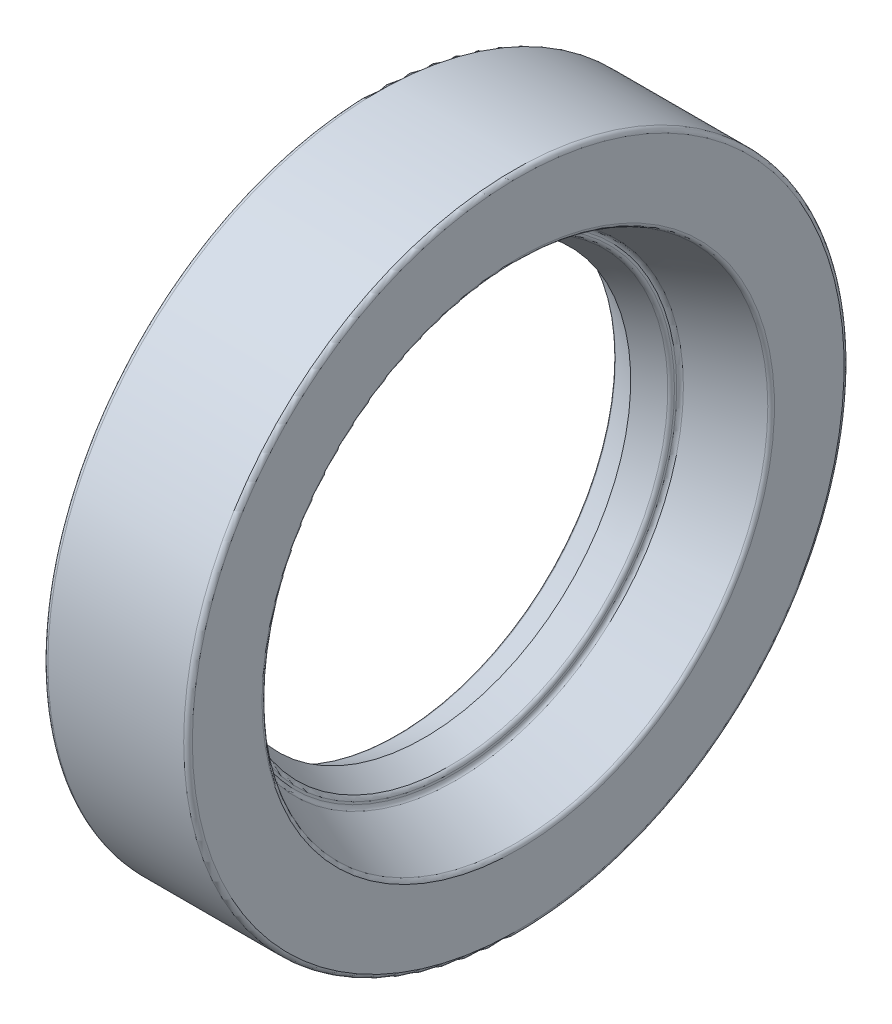
ISO-10303-21;
HEADER;
FILE_DESCRIPTION(('STEP AP214'),'2;1');
FILE_NAME('part.step','',(''),(''),'','','');
FILE_SCHEMA(('AUTOMOTIVE_DESIGN { 1 0 10303 214 1 1 1 1 }'));
ENDSEC;
DATA;
#1=APPLICATION_CONTEXT('core data for automotive mechanical design processes');
#2=APPLICATION_PROTOCOL_DEFINITION('international standard','automotive_design',2000,#1);
#3=PRODUCT_CONTEXT('',#1,'mechanical');
#4=PRODUCT('Part','Part','',(#3));
#5=PRODUCT_RELATED_PRODUCT_CATEGORY('part','',(#4));
#6=PRODUCT_DEFINITION_FORMATION('','',#4);
#7=PRODUCT_DEFINITION_CONTEXT('part definition',#1,'design');
#8=PRODUCT_DEFINITION('design','',#6,#7);
#9=PRODUCT_DEFINITION_SHAPE('','',#8);
#10=(LENGTH_UNIT() NAMED_UNIT(*) SI_UNIT(.MILLI.,.METRE.));
#11=(NAMED_UNIT(*) PLANE_ANGLE_UNIT() SI_UNIT($,.RADIAN.));
#12=(NAMED_UNIT(*) SI_UNIT($,.STERADIAN.) SOLID_ANGLE_UNIT());
#13=UNCERTAINTY_MEASURE_WITH_UNIT(LENGTH_MEASURE(1.E-05),#10,'distance_accuracy_value','');
#14=(GEOMETRIC_REPRESENTATION_CONTEXT(3) GLOBAL_UNCERTAINTY_ASSIGNED_CONTEXT((#13)) GLOBAL_UNIT_ASSIGNED_CONTEXT((#10,
#11,#12)) REPRESENTATION_CONTEXT('',''));
#15=CARTESIAN_POINT('',(0.,0.,0.));
#16=DIRECTION('',(0.,0.,1.));
#17=DIRECTION('',(1.,0.,0.));
#18=AXIS2_PLACEMENT_3D('',#15,#16,#17);
#19=CARTESIAN_POINT('',(0.,0.,0.));
#20=DIRECTION('',(-1.,0.,0.));
#21=DIRECTION('',(0.,0.,1.));
#22=AXIS2_PLACEMENT_3D('',#19,#20,#21);
#23=TOROIDAL_SURFACE('',#22,11.75,0.105);
#24=CARTESIAN_POINT('',(0.,0.,11.855));
#25=VERTEX_POINT('',#24);
#26=VERTEX_LOOP('',#25);
#27=FACE_BOUND('',#26,.T.);
#28=ADVANCED_FACE('F36',(#27),#23,.T.);
#29=CLOSED_SHELL('',(#28));
#30=MANIFOLD_SOLID_BREP('B2',#29);
#31=CARTESIAN_POINT('',(0.,0.,0.));
#32=DIRECTION('',(-1.,0.,0.));
#33=DIRECTION('',(0.,0.,1.));
#34=AXIS2_PLACEMENT_3D('',#31,#32,#33);
#35=TOROIDAL_SURFACE('',#34,11.75,0.525000000000003);
#36=CARTESIAN_POINT('',(0.,0.,12.275));
#37=VERTEX_POINT('',#36);
#38=VERTEX_LOOP('',#37);
#39=FACE_BOUND('',#38,.T.);
#40=ADVANCED_FACE('F57',(#39),#35,.T.);
#41=CLOSED_SHELL('',(#40));
#42=CARTESIAN_POINT('',(0.,0.,0.));
#43=DIRECTION('',(-1.,0.,0.));
#44=DIRECTION('',(0.,0.,1.));
#45=AXIS2_PLACEMENT_3D('',#42,#43,#44);
#46=TOROIDAL_SURFACE('',#45,11.75,0.425516390000003);
#47=CARTESIAN_POINT('',(0.,0.,12.17551639));
#48=VERTEX_POINT('',#47);
#49=VERTEX_LOOP('',#48);
#50=FACE_BOUND('',#49,.T.);
#51=ADVANCED_FACE('F70',(#50),#46,.F.);
#52=CLOSED_SHELL('',(#51));
#53=ORIENTED_CLOSED_SHELL('',*,#52,.T.);
#54=BREP_WITH_VOIDS('B6',#41,(#53));
#55=CARTESIAN_POINT('',(-2.45,15.16,0.));
#56=DIRECTION('',(1.,0.,0.));
#57=DIRECTION('',(0.,0.,-1.));
#58=AXIS2_PLACEMENT_3D('',#55,#56,#57);
#59=PLANE('',#58);
#60=CARTESIAN_POINT('',(-2.45,0.,0.));
#61=DIRECTION('',(1.,0.,0.));
#62=DIRECTION('',(0.,0.,-1.));
#63=AXIS2_PLACEMENT_3D('',#60,#61,#62);
#64=CIRCLE('',#63,15.3627946427095);
#65=CARTESIAN_POINT('',(-2.45,0.,-15.3627946427095));
#66=VERTEX_POINT('',#65);
#67=EDGE_CURVE('E100',#66,#66,#64,.T.);
#68=ORIENTED_EDGE('',*,*,#67,.T.);
#69=EDGE_LOOP('',(#68));
#70=FACE_BOUND('',#69,.T.);
#71=CARTESIAN_POINT('',(-2.45,0.,0.));
#72=DIRECTION('',(1.,0.,0.));
#73=DIRECTION('',(0.,0.,-1.));
#74=AXIS2_PLACEMENT_3D('',#71,#72,#73);
#75=CIRCLE('',#74,15.79);
#76=CARTESIAN_POINT('',(-2.45,0.,-15.79));
#77=VERTEX_POINT('',#76);
#78=EDGE_CURVE('E103',#77,#77,#75,.F.);
#79=ORIENTED_EDGE('',*,*,#78,.T.);
#80=EDGE_LOOP('',(#79));
#81=FACE_BOUND('',#80,.T.);
#82=ADVANCED_FACE('F81',(#70,#81),#59,.F.);
#83=CARTESIAN_POINT('',(-2.45,0.,0.));
#84=DIRECTION('',(-1.,0.,0.));
#85=DIRECTION('',(0.,0.,1.));
#86=AXIS2_PLACEMENT_3D('',#83,#84,#85);
#87=CONICAL_SURFACE('',#86,15.16,0.0349065850398794);
#88=CARTESIAN_POINT('',(3.29732889430752,0.,0.));
#89=DIRECTION('',(-1.,0.,0.));
#90=DIRECTION('',(0.,0.,1.));
#91=AXIS2_PLACEMENT_3D('',#88,#89,#90);
#92=CIRCLE('',#91,14.9592988524887);
#93=CARTESIAN_POINT('',(3.29732889430752,0.,14.9592988524887));
#94=VERTEX_POINT('',#93);
#95=EDGE_CURVE('E106',#94,#94,#92,.F.);
#96=ORIENTED_EDGE('',*,*,#95,.T.);
#97=EDGE_LOOP('',(#96));
#98=FACE_BOUND('',#97,.T.);
#99=CARTESIAN_POINT('',(-2.24732889430751,0.,0.));
#100=DIRECTION('',(1.,0.,0.));
#101=DIRECTION('',(0.,0.,-1.));
#102=AXIS2_PLACEMENT_3D('',#99,#100,#101);
#103=CIRCLE('',#102,15.1529225690355);
#104=CARTESIAN_POINT('',(-2.24732889430751,0.,-15.1529225690355));
#105=VERTEX_POINT('',#104);
#106=EDGE_CURVE('E109',#105,#105,#103,.F.);
#107=ORIENTED_EDGE('',*,*,#106,.T.);
#108=EDGE_LOOP('',(#107));
#109=FACE_BOUND('',#108,.T.);
#110=ADVANCED_FACE('F182',(#98,#109),#87,.F.);
#111=CARTESIAN_POINT('',(3.5,12.3856014284556,0.));
#112=DIRECTION('',(1.,0.,0.));
#113=DIRECTION('',(0.,0.,-1.));
#114=AXIS2_PLACEMENT_3D('',#111,#112,#113);
#115=PLANE('',#114);
#116=CARTESIAN_POINT('',(3.5,0.,0.));
#117=DIRECTION('',(1.,0.,0.));
#118=DIRECTION('',(0.,0.,-1.));
#119=AXIS2_PLACEMENT_3D('',#116,#117,#118);
#120=CIRCLE('',#119,12.5259189424187);
#121=CARTESIAN_POINT('',(3.5,0.,-12.5259189424187));
#122=VERTEX_POINT('',#121);
#123=EDGE_CURVE('E112',#122,#122,#120,.T.);
#124=ORIENTED_EDGE('',*,*,#123,.T.);
#125=EDGE_LOOP('',(#124));
#126=FACE_BOUND('',#125,.T.);
#127=CARTESIAN_POINT('',(3.5,0.,0.));
#128=DIRECTION('',(1.,0.,0.));
#129=DIRECTION('',(0.,0.,-1.));
#130=AXIS2_PLACEMENT_3D('',#127,#128,#129);
#131=CIRCLE('',#130,14.7494267788147);
#132=CARTESIAN_POINT('',(3.5,0.,-14.7494267788147));
#133=VERTEX_POINT('',#132);
#134=EDGE_CURVE('E115',#133,#133,#131,.F.);
#135=ORIENTED_EDGE('',*,*,#134,.T.);
#136=EDGE_LOOP('',(#135));
#137=FACE_BOUND('',#136,.T.);
#138=ADVANCED_FACE('F187',(#126,#137),#115,.F.);
#139=CARTESIAN_POINT('',(3.5,0.,0.));
#140=DIRECTION('',(1.,0.,0.));
#141=DIRECTION('',(0.,0.,-1.));
#142=AXIS2_PLACEMENT_3D('',#139,#140,#141);
#143=CONICAL_SURFACE('',#142,12.3856014284556,0.392699081698726);
#144=CARTESIAN_POINT('',(2.00411433480569,0.,0.));
#145=DIRECTION('',(1.,0.,0.));
#146=DIRECTION('',(0.,0.,-1.));
#147=AXIS2_PLACEMENT_3D('',#144,#145,#146);
#148=CIRCLE('',#147,11.7659852981726);
#149=CARTESIAN_POINT('',(2.00411433480569,0.,-11.7659852981726));
#150=VERTEX_POINT('',#149);
#151=EDGE_CURVE('E118',#150,#150,#148,.T.);
#152=ORIENTED_EDGE('',*,*,#151,.T.);
#153=EDGE_LOOP('',(#152));
#154=FACE_BOUND('',#153,.T.);
#155=CARTESIAN_POINT('',(3.37036352079667,0.,0.));
#156=DIRECTION('',(1.,0.,0.));
#157=DIRECTION('',(0.,0.,-1.));
#158=AXIS2_PLACEMENT_3D('',#155,#156,#157);
#159=CIRCLE('',#158,12.3319042405913);
#160=CARTESIAN_POINT('',(3.37036352079667,0.,-12.3319042405913));
#161=VERTEX_POINT('',#160);
#162=EDGE_CURVE('E121',#161,#161,#159,.F.);
#163=ORIENTED_EDGE('',*,*,#162,.T.);
#164=EDGE_LOOP('',(#163));
#165=FACE_BOUND('',#164,.T.);
#166=ADVANCED_FACE('F393',(#154,#165),#143,.T.);
#167=CARTESIAN_POINT('',(0.,0.,0.));
#168=DIRECTION('',(-1.,0.,0.));
#169=DIRECTION('',(0.,0.,1.));
#170=AXIS2_PLACEMENT_3D('',#167,#168,#169);
#171=CYLINDRICAL_SURFACE('',#170,11.75);
#172=CARTESIAN_POINT('',(1.92375081400902,0.,0.));
#173=DIRECTION('',(-1.,0.,0.));
#174=DIRECTION('',(0.,0.,1.));
#175=AXIS2_PLACEMENT_3D('',#172,#173,#174);
#176=CIRCLE('',#175,11.75);
#177=CARTESIAN_POINT('',(1.92375081400902,0.,11.75));
#178=VERTEX_POINT('',#177);
#179=EDGE_CURVE('E124',#178,#178,#176,.T.);
#180=ORIENTED_EDGE('',*,*,#179,.T.);
#181=EDGE_LOOP('',(#180));
#182=FACE_BOUND('',#181,.T.);
#183=CARTESIAN_POINT('',(0.525000000000003,0.,0.));
#184=DIRECTION('',(-1.,0.,0.));
#185=DIRECTION('',(0.,0.,1.));
#186=AXIS2_PLACEMENT_3D('',#183,#184,#185);
#187=CIRCLE('',#186,11.75);
#188=CARTESIAN_POINT('',(0.525000000000003,0.,11.75));
#189=VERTEX_POINT('',#188);
#190=EDGE_CURVE('E154',#189,#189,#187,.T.);
#191=ORIENTED_EDGE('',*,*,#190,.F.);
#192=EDGE_LOOP('',(#191));
#193=FACE_BOUND('',#192,.T.);
#194=ADVANCED_FACE('F385',(#182,#193),#171,.T.);
#195=CARTESIAN_POINT('',(0.,0.,0.));
#196=DIRECTION('',(-1.,0.,0.));
#197=DIRECTION('',(0.,0.,1.));
#198=AXIS2_PLACEMENT_3D('',#195,#196,#197);
#199=TOROIDAL_SURFACE('',#198,11.75,0.525000000000003);
#200=CARTESIAN_POINT('',(-0.525,0.,0.));
#201=DIRECTION('',(-1.,0.,0.));
#202=DIRECTION('',(0.,0.,1.));
#203=AXIS2_PLACEMENT_3D('',#200,#201,#202);
#204=CIRCLE('',#203,11.75);
#205=CARTESIAN_POINT('',(-0.525,0.,11.75));
#206=VERTEX_POINT('',#205);
#207=EDGE_CURVE('E157',#206,#206,#204,.T.);
#208=ORIENTED_EDGE('',*,*,#207,.F.);
#209=EDGE_LOOP('',(#208));
#210=FACE_BOUND('',#209,.T.);
#211=ORIENTED_EDGE('',*,*,#190,.T.);
#212=EDGE_LOOP('',(#211));
#213=FACE_BOUND('',#212,.T.);
#214=ADVANCED_FACE('F375',(#210,#213),#199,.F.);
#215=CARTESIAN_POINT('',(0.,0.,0.));
#216=DIRECTION('',(-1.,0.,0.));
#217=DIRECTION('',(0.,0.,1.));
#218=AXIS2_PLACEMENT_3D('',#215,#216,#217);
#219=CYLINDRICAL_SURFACE('',#218,11.75);
#220=CARTESIAN_POINT('',(-1.19,0.,0.));
#221=DIRECTION('',(1.,0.,0.));
#222=DIRECTION('',(0.,0.,-1.));
#223=AXIS2_PLACEMENT_3D('',#220,#221,#222);
#224=CIRCLE('',#223,11.75);
#225=CARTESIAN_POINT('',(-1.19,0.,-11.75));
#226=VERTEX_POINT('',#225);
#227=EDGE_CURVE('E127',#226,#226,#224,.T.);
#228=ORIENTED_EDGE('',*,*,#227,.T.);
#229=EDGE_LOOP('',(#228));
#230=FACE_BOUND('',#229,.T.);
#231=ORIENTED_EDGE('',*,*,#207,.T.);
#232=EDGE_LOOP('',(#231));
#233=FACE_BOUND('',#232,.T.);
#234=ADVANCED_FACE('F178',(#230,#233),#219,.T.);
#235=CARTESIAN_POINT('',(-1.4,10.5798989873223,0.));
#236=DIRECTION('',(1.,0.,0.));
#237=DIRECTION('',(0.,0.,-1.));
#238=AXIS2_PLACEMENT_3D('',#235,#236,#237);
#239=PLANE('',#238);
#240=CARTESIAN_POINT('',(-1.4,0.,0.));
#241=DIRECTION('',(1.,0.,0.));
#242=DIRECTION('',(0.,0.,-1.));
#243=AXIS2_PLACEMENT_3D('',#240,#241,#242);
#244=CIRCLE('',#243,10.7202165012854);
#245=CARTESIAN_POINT('',(-1.4,0.,-10.7202165012854));
#246=VERTEX_POINT('',#245);
#247=EDGE_CURVE('E130',#246,#246,#244,.T.);
#248=ORIENTED_EDGE('',*,*,#247,.T.);
#249=EDGE_LOOP('',(#248));
#250=FACE_BOUND('',#249,.T.);
#251=CARTESIAN_POINT('',(-1.4,0.,0.));
#252=DIRECTION('',(1.,0.,0.));
#253=DIRECTION('',(0.,0.,-1.));
#254=AXIS2_PLACEMENT_3D('',#251,#252,#253);
#255=CIRCLE('',#254,11.54);
#256=CARTESIAN_POINT('',(-1.4,0.,-11.54));
#257=VERTEX_POINT('',#256);
#258=EDGE_CURVE('E133',#257,#257,#255,.F.);
#259=ORIENTED_EDGE('',*,*,#258,.T.);
#260=EDGE_LOOP('',(#259));
#261=FACE_BOUND('',#260,.T.);
#262=ADVANCED_FACE('F168',(#250,#261),#239,.F.);
#263=CARTESIAN_POINT('',(-1.4,0.,0.));
#264=DIRECTION('',(-1.,0.,0.));
#265=DIRECTION('',(0.,0.,1.));
#266=AXIS2_PLACEMENT_3D('',#263,#264,#265);
#267=CONICAL_SURFACE('',#266,10.5798989873223,0.392699081698726);
#268=CARTESIAN_POINT('',(-1.27036352079667,0.,0.));
#269=DIRECTION('',(1.,0.,0.));
#270=DIRECTION('',(0.,0.,-1.));
#271=AXIS2_PLACEMENT_3D('',#268,#269,#270);
#272=CIRCLE('',#271,10.526201799458);
#273=CARTESIAN_POINT('',(-1.27036352079667,0.,-10.526201799458));
#274=VERTEX_POINT('',#273);
#275=EDGE_CURVE('E136',#274,#274,#272,.F.);
#276=ORIENTED_EDGE('',*,*,#275,.T.);
#277=EDGE_LOOP('',(#276));
#278=FACE_BOUND('',#277,.T.);
#279=CARTESIAN_POINT('',(0.,0.,0.));
#280=DIRECTION('',(-1.,0.,0.));
#281=DIRECTION('',(0.,0.,1.));
#282=AXIS2_PLACEMENT_3D('',#279,#280,#281);
#283=CIRCLE('',#282,10.);
#284=CARTESIAN_POINT('',(0.,0.,10.));
#285=VERTEX_POINT('',#284);
#286=EDGE_CURVE('E160',#285,#285,#283,.T.);
#287=ORIENTED_EDGE('',*,*,#286,.F.);
#288=EDGE_LOOP('',(#287));
#289=FACE_BOUND('',#288,.T.);
#290=ADVANCED_FACE('F166',(#278,#289),#267,.F.);
#291=CARTESIAN_POINT('',(0.,0.,0.));
#292=DIRECTION('',(1.,0.,0.));
#293=DIRECTION('',(0.,0.,-1.));
#294=AXIS2_PLACEMENT_3D('',#291,#292,#293);
#295=CONICAL_SURFACE('',#294,10.,0.392699081698726);
#296=CARTESIAN_POINT('',(1.27036352079667,0.,0.));
#297=DIRECTION('',(-1.,0.,0.));
#298=DIRECTION('',(0.,0.,1.));
#299=AXIS2_PLACEMENT_3D('',#296,#297,#298);
#300=CIRCLE('',#299,10.526201799458);
#301=CARTESIAN_POINT('',(1.27036352079667,0.,10.526201799458));
#302=VERTEX_POINT('',#301);
#303=EDGE_CURVE('E139',#302,#302,#300,.F.);
#304=ORIENTED_EDGE('',*,*,#303,.T.);
#305=EDGE_LOOP('',(#304));
#306=FACE_BOUND('',#305,.T.);
#307=ORIENTED_EDGE('',*,*,#286,.T.);
#308=EDGE_LOOP('',(#307));
#309=FACE_BOUND('',#308,.T.);
#310=ADVANCED_FACE('F164',(#306,#309),#295,.F.);
#311=CARTESIAN_POINT('',(1.4,10.9702272785248,0.));
#312=DIRECTION('',(-1.,0.,0.));
#313=DIRECTION('',(0.,0.,1.));
#314=AXIS2_PLACEMENT_3D('',#311,#312,#313);
#315=PLANE('',#314);
#316=CARTESIAN_POINT('',(1.4,0.,0.));
#317=DIRECTION('',(-1.,0.,0.));
#318=DIRECTION('',(0.,0.,1.));
#319=AXIS2_PLACEMENT_3D('',#316,#317,#318);
#320=CIRCLE('',#319,10.8299097645617);
#321=CARTESIAN_POINT('',(1.4,0.,10.8299097645617));
#322=VERTEX_POINT('',#321);
#323=EDGE_CURVE('E142',#322,#322,#320,.F.);
#324=ORIENTED_EDGE('',*,*,#323,.T.);
#325=EDGE_LOOP('',(#324));
#326=FACE_BOUND('',#325,.T.);
#327=CARTESIAN_POINT('',(1.4,0.,0.));
#328=DIRECTION('',(-1.,0.,0.));
#329=DIRECTION('',(0.,0.,1.));
#330=AXIS2_PLACEMENT_3D('',#327,#328,#329);
#331=CIRCLE('',#330,10.7202165012854);
#332=CARTESIAN_POINT('',(1.4,0.,10.7202165012854));
#333=VERTEX_POINT('',#332);
#334=EDGE_CURVE('E145',#333,#333,#331,.T.);
#335=ORIENTED_EDGE('',*,*,#334,.T.);
#336=EDGE_LOOP('',(#335));
#337=FACE_BOUND('',#336,.T.);
#338=ADVANCED_FACE('F175',(#326,#337),#315,.F.);
#339=CARTESIAN_POINT('',(1.4,0.,0.));
#340=DIRECTION('',(1.,0.,0.));
#341=DIRECTION('',(0.,0.,-1.));
#342=AXIS2_PLACEMENT_3D('',#339,#340,#341);
#343=CONICAL_SURFACE('',#342,10.9702272785248,0.392699081698724);
#344=CARTESIAN_POINT('',(1.52963647920334,0.,0.));
#345=DIRECTION('',(1.,0.,0.));
#346=DIRECTION('',(0.,0.,-1.));
#347=AXIS2_PLACEMENT_3D('',#344,#345,#346);
#348=CIRCLE('',#347,11.0239244663891);
#349=CARTESIAN_POINT('',(1.52963647920334,0.,-11.0239244663891));
#350=VERTEX_POINT('',#349);
#351=EDGE_CURVE('E148',#350,#350,#348,.F.);
#352=ORIENTED_EDGE('',*,*,#351,.T.);
#353=EDGE_LOOP('',(#352));
#354=FACE_BOUND('',#353,.T.);
#355=CARTESIAN_POINT('',(4.42036352079667,0.,0.));
#356=DIRECTION('',(-1.,0.,0.));
#357=DIRECTION('',(0.,0.,1.));
#358=AXIS2_PLACEMENT_3D('',#355,#356,#357);
#359=CIRCLE('',#358,12.2213028121357);
#360=CARTESIAN_POINT('',(4.42036352079667,0.,12.2213028121357));
#361=VERTEX_POINT('',#360);
#362=EDGE_CURVE('E151',#361,#361,#359,.F.);
#363=ORIENTED_EDGE('',*,*,#362,.T.);
#364=EDGE_LOOP('',(#363));
#365=FACE_BOUND('',#364,.T.);
#366=ADVANCED_FACE('F246',(#354,#365),#343,.F.);
#367=CARTESIAN_POINT('',(4.55,16.,0.));
#368=DIRECTION('',(-1.,0.,0.));
#369=DIRECTION('',(0.,0.,1.));
#370=AXIS2_PLACEMENT_3D('',#367,#368,#369);
#371=PLANE('',#370);
#372=CARTESIAN_POINT('',(4.55,0.,0.));
#373=DIRECTION('',(-1.,0.,0.));
#374=DIRECTION('',(0.,0.,1.));
#375=AXIS2_PLACEMENT_3D('',#372,#373,#374);
#376=CIRCLE('',#375,12.4153175139631);
#377=CARTESIAN_POINT('',(4.55,0.,12.4153175139631));
#378=VERTEX_POINT('',#377);
#379=EDGE_CURVE('E55',#378,#378,#376,.T.);
#380=ORIENTED_EDGE('',*,*,#379,.T.);
#381=EDGE_LOOP('',(#380));
#382=FACE_BOUND('',#381,.T.);
#383=CARTESIAN_POINT('',(4.55,0.,0.));
#384=DIRECTION('',(-1.,0.,0.));
#385=DIRECTION('',(0.,0.,1.));
#386=AXIS2_PLACEMENT_3D('',#383,#384,#385);
#387=CIRCLE('',#386,15.79);
#388=CARTESIAN_POINT('',(4.55,0.,15.79));
#389=VERTEX_POINT('',#388);
#390=EDGE_CURVE('E87',#389,#389,#387,.F.);
#391=ORIENTED_EDGE('',*,*,#390,.T.);
#392=EDGE_LOOP('',(#391));
#393=FACE_BOUND('',#392,.T.);
#394=ADVANCED_FACE('F242',(#382,#393),#371,.F.);
#395=CARTESIAN_POINT('',(0.,0.,0.));
#396=DIRECTION('',(-1.,0.,0.));
#397=DIRECTION('',(0.,0.,1.));
#398=AXIS2_PLACEMENT_3D('',#395,#396,#397);
#399=CYLINDRICAL_SURFACE('',#398,16.);
#400=CARTESIAN_POINT('',(-2.24,0.,0.));
#401=DIRECTION('',(1.,0.,0.));
#402=DIRECTION('',(0.,0.,-1.));
#403=AXIS2_PLACEMENT_3D('',#400,#401,#402);
#404=CIRCLE('',#403,16.);
#405=CARTESIAN_POINT('',(-2.24,0.,-16.));
#406=VERTEX_POINT('',#405);
#407=EDGE_CURVE('E91',#406,#406,#404,.T.);
#408=ORIENTED_EDGE('',*,*,#407,.T.);
#409=EDGE_LOOP('',(#408));
#410=FACE_BOUND('',#409,.T.);
#411=CARTESIAN_POINT('',(4.34,0.,0.));
#412=DIRECTION('',(-1.,0.,0.));
#413=DIRECTION('',(0.,0.,1.));
#414=AXIS2_PLACEMENT_3D('',#411,#412,#413);
#415=CIRCLE('',#414,16.);
#416=CARTESIAN_POINT('',(4.34,0.,16.));
#417=VERTEX_POINT('',#416);
#418=EDGE_CURVE('E95',#417,#417,#415,.T.);
#419=ORIENTED_EDGE('',*,*,#418,.T.);
#420=EDGE_LOOP('',(#419));
#421=FACE_BOUND('',#420,.T.);
#422=ADVANCED_FACE('F238',(#410,#421),#399,.T.);
#423=CARTESIAN_POINT('',(1.61,0.,0.));
#424=DIRECTION('',(-1.,0.,0.));
#425=DIRECTION('',(0.,0.,1.));
#426=AXIS2_PLACEMENT_3D('',#423,#424,#425);
#427=TOROIDAL_SURFACE('',#426,10.8299097645617,0.21);
#428=ORIENTED_EDGE('',*,*,#323,.F.);
#429=EDGE_LOOP('',(#428));
#430=FACE_BOUND('',#429,.T.);
#431=ORIENTED_EDGE('',*,*,#351,.F.);
#432=EDGE_LOOP('',(#431));
#433=FACE_BOUND('',#432,.T.);
#434=ADVANCED_FACE('F234',(#430,#433),#427,.F.);
#435=CARTESIAN_POINT('',(1.19,0.,0.));
#436=DIRECTION('',(-1.,0.,0.));
#437=DIRECTION('',(0.,0.,1.));
#438=AXIS2_PLACEMENT_3D('',#435,#436,#437);
#439=TOROIDAL_SURFACE('',#438,10.7202165012854,0.21);
#440=ORIENTED_EDGE('',*,*,#303,.F.);
#441=EDGE_LOOP('',(#440));
#442=FACE_BOUND('',#441,.T.);
#443=ORIENTED_EDGE('',*,*,#334,.F.);
#444=EDGE_LOOP('',(#443));
#445=FACE_BOUND('',#444,.T.);
#446=ADVANCED_FACE('F230',(#442,#445),#439,.T.);
#447=CARTESIAN_POINT('',(-1.19,0.,0.));
#448=DIRECTION('',(1.,0.,0.));
#449=DIRECTION('',(0.,0.,-1.));
#450=AXIS2_PLACEMENT_3D('',#447,#448,#449);
#451=TOROIDAL_SURFACE('',#450,10.7202165012854,0.21);
#452=ORIENTED_EDGE('',*,*,#247,.F.);
#453=EDGE_LOOP('',(#452));
#454=FACE_BOUND('',#453,.T.);
#455=ORIENTED_EDGE('',*,*,#275,.F.);
#456=EDGE_LOOP('',(#455));
#457=FACE_BOUND('',#456,.T.);
#458=ADVANCED_FACE('F226',(#454,#457),#451,.T.);
#459=CARTESIAN_POINT('',(-1.19,0.,0.));
#460=DIRECTION('',(1.,0.,0.));
#461=DIRECTION('',(0.,0.,-1.));
#462=AXIS2_PLACEMENT_3D('',#459,#460,#461);
#463=TOROIDAL_SURFACE('',#462,11.54,0.21);
#464=ORIENTED_EDGE('',*,*,#227,.F.);
#465=EDGE_LOOP('',(#464));
#466=FACE_BOUND('',#465,.T.);
#467=ORIENTED_EDGE('',*,*,#258,.F.);
#468=EDGE_LOOP('',(#467));
#469=FACE_BOUND('',#468,.T.);
#470=ADVANCED_FACE('F222',(#466,#469),#463,.T.);
#471=CARTESIAN_POINT('',(1.92375081400902,0.,0.));
#472=DIRECTION('',(-1.,0.,0.));
#473=DIRECTION('',(0.,0.,1.));
#474=AXIS2_PLACEMENT_3D('',#471,#472,#473);
#475=TOROIDAL_SURFACE('',#474,11.96,0.21);
#476=ORIENTED_EDGE('',*,*,#151,.F.);
#477=EDGE_LOOP('',(#476));
#478=FACE_BOUND('',#477,.T.);
#479=ORIENTED_EDGE('',*,*,#179,.F.);
#480=EDGE_LOOP('',(#479));
#481=FACE_BOUND('',#480,.T.);
#482=ADVANCED_FACE('F218',(#478,#481),#475,.F.);
#483=CARTESIAN_POINT('',(3.29,0.,0.));
#484=DIRECTION('',(1.,0.,0.));
#485=DIRECTION('',(0.,0.,-1.));
#486=AXIS2_PLACEMENT_3D('',#483,#484,#485);
#487=TOROIDAL_SURFACE('',#486,12.5259189424187,0.21);
#488=ORIENTED_EDGE('',*,*,#123,.F.);
#489=EDGE_LOOP('',(#488));
#490=FACE_BOUND('',#489,.T.);
#491=ORIENTED_EDGE('',*,*,#162,.F.);
#492=EDGE_LOOP('',(#491));
#493=FACE_BOUND('',#492,.T.);
#494=ADVANCED_FACE('F214',(#490,#493),#487,.F.);
#495=CARTESIAN_POINT('',(3.29,0.,0.));
#496=DIRECTION('',(1.,0.,0.));
#497=DIRECTION('',(0.,0.,-1.));
#498=AXIS2_PLACEMENT_3D('',#495,#496,#497);
#499=TOROIDAL_SURFACE('',#498,14.7494267788147,0.21);
#500=ORIENTED_EDGE('',*,*,#95,.F.);
#501=EDGE_LOOP('',(#500));
#502=FACE_BOUND('',#501,.T.);
#503=ORIENTED_EDGE('',*,*,#134,.F.);
#504=EDGE_LOOP('',(#503));
#505=FACE_BOUND('',#504,.T.);
#506=ADVANCED_FACE('F206',(#502,#505),#499,.F.);
#507=CARTESIAN_POINT('',(-2.24,0.,0.));
#508=DIRECTION('',(1.,0.,0.));
#509=DIRECTION('',(0.,0.,-1.));
#510=AXIS2_PLACEMENT_3D('',#507,#508,#509);
#511=TOROIDAL_SURFACE('',#510,15.3627946427095,0.21);
#512=ORIENTED_EDGE('',*,*,#67,.F.);
#513=EDGE_LOOP('',(#512));
#514=FACE_BOUND('',#513,.T.);
#515=ORIENTED_EDGE('',*,*,#106,.F.);
#516=EDGE_LOOP('',(#515));
#517=FACE_BOUND('',#516,.T.);
#518=ADVANCED_FACE('F196',(#514,#517),#511,.T.);
#519=CARTESIAN_POINT('',(-2.24,0.,0.));
#520=DIRECTION('',(1.,0.,0.));
#521=DIRECTION('',(0.,0.,-1.));
#522=AXIS2_PLACEMENT_3D('',#519,#520,#521);
#523=TOROIDAL_SURFACE('',#522,15.79,0.21);
#524=ORIENTED_EDGE('',*,*,#407,.F.);
#525=EDGE_LOOP('',(#524));
#526=FACE_BOUND('',#525,.T.);
#527=ORIENTED_EDGE('',*,*,#78,.F.);
#528=EDGE_LOOP('',(#527));
#529=FACE_BOUND('',#528,.T.);
#530=ADVANCED_FACE('F193',(#526,#529),#523,.T.);
#531=CARTESIAN_POINT('',(4.34,0.,0.));
#532=DIRECTION('',(-1.,0.,0.));
#533=DIRECTION('',(0.,0.,1.));
#534=AXIS2_PLACEMENT_3D('',#531,#532,#533);
#535=TOROIDAL_SURFACE('',#534,12.4153175139631,0.21);
#536=ORIENTED_EDGE('',*,*,#362,.F.);
#537=EDGE_LOOP('',(#536));
#538=FACE_BOUND('',#537,.T.);
#539=ORIENTED_EDGE('',*,*,#379,.F.);
#540=EDGE_LOOP('',(#539));
#541=FACE_BOUND('',#540,.T.);
#542=ADVANCED_FACE('F195',(#538,#541),#535,.T.);
#543=CARTESIAN_POINT('',(4.34,0.,0.));
#544=DIRECTION('',(-1.,0.,0.));
#545=DIRECTION('',(0.,0.,1.));
#546=AXIS2_PLACEMENT_3D('',#543,#544,#545);
#547=TOROIDAL_SURFACE('',#546,15.79,0.21);
#548=ORIENTED_EDGE('',*,*,#390,.F.);
#549=EDGE_LOOP('',(#548));
#550=FACE_BOUND('',#549,.T.);
#551=ORIENTED_EDGE('',*,*,#418,.F.);
#552=EDGE_LOOP('',(#551));
#553=FACE_BOUND('',#552,.T.);
#554=ADVANCED_FACE('F203',(#550,#553),#547,.T.);
#555=CLOSED_SHELL('',(#82,#110,#138,#166,#194,#214,#234,#262,#290,#310,#338,#366,#394,#422,#434,
#446,#458,#470,#482,#494,#506,#518,#530,#542,#554));
#556=MANIFOLD_SOLID_BREP('B32',#555);
#557=ADVANCED_BREP_SHAPE_REPRESENTATION('',(#18,#30,#54,#556),#14);
#558=SHAPE_DEFINITION_REPRESENTATION(#9,#557);
ENDSEC;
END-ISO-10303-21;
